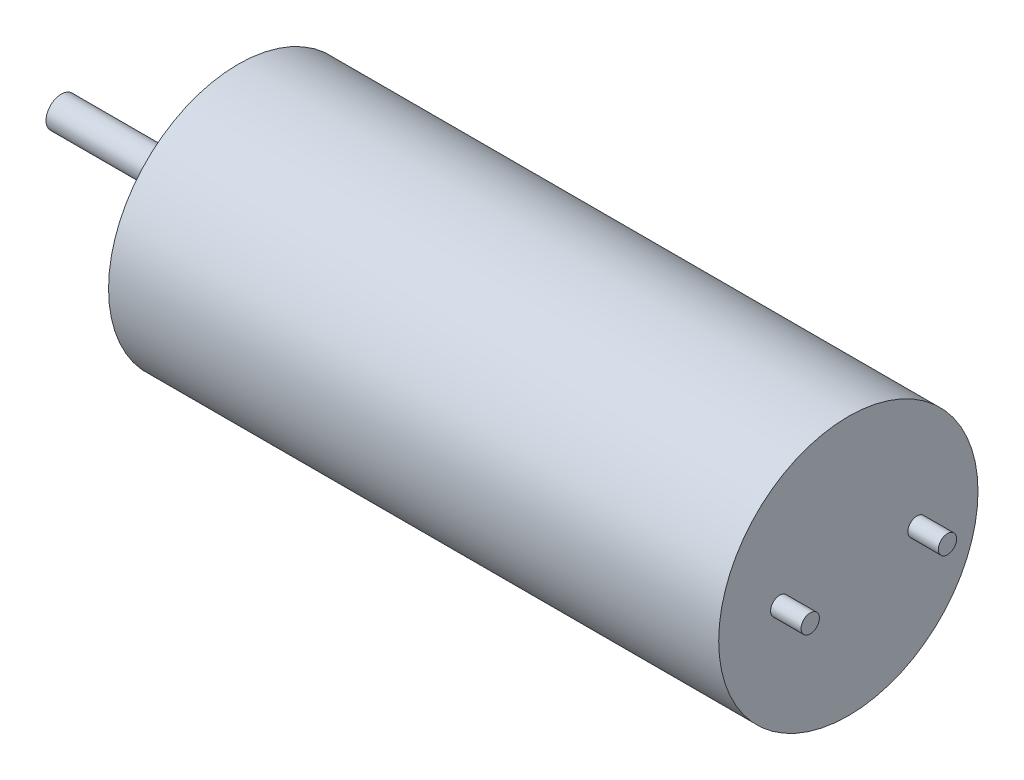
ISO-10303-21;
HEADER;
FILE_DESCRIPTION(('STEP AP214'),'2;1');
FILE_NAME('part.step','',(''),(''),'','','');
FILE_SCHEMA(('AUTOMOTIVE_DESIGN { 1 0 10303 214 1 1 1 1 }'));
ENDSEC;
DATA;
#1=APPLICATION_CONTEXT('core data for automotive mechanical design processes');
#2=APPLICATION_PROTOCOL_DEFINITION('international standard','automotive_design',2000,#1);
#3=PRODUCT_CONTEXT('',#1,'mechanical');
#4=PRODUCT('Part','Part','',(#3));
#5=PRODUCT_RELATED_PRODUCT_CATEGORY('part','',(#4));
#6=PRODUCT_DEFINITION_FORMATION('','',#4);
#7=PRODUCT_DEFINITION_CONTEXT('part definition',#1,'design');
#8=PRODUCT_DEFINITION('design','',#6,#7);
#9=PRODUCT_DEFINITION_SHAPE('','',#8);
#10=(LENGTH_UNIT() NAMED_UNIT(*) SI_UNIT(.MILLI.,.METRE.));
#11=(NAMED_UNIT(*) PLANE_ANGLE_UNIT() SI_UNIT($,.RADIAN.));
#12=(NAMED_UNIT(*) SI_UNIT($,.STERADIAN.) SOLID_ANGLE_UNIT());
#13=UNCERTAINTY_MEASURE_WITH_UNIT(LENGTH_MEASURE(1.E-05),#10,'distance_accuracy_value','');
#14=(GEOMETRIC_REPRESENTATION_CONTEXT(3) GLOBAL_UNCERTAINTY_ASSIGNED_CONTEXT((#13)) GLOBAL_UNIT_ASSIGNED_CONTEXT((#10,
#11,#12)) REPRESENTATION_CONTEXT('',''));
#15=CARTESIAN_POINT('',(0.,0.,0.));
#16=DIRECTION('',(0.,0.,1.));
#17=DIRECTION('',(1.,0.,0.));
#18=AXIS2_PLACEMENT_3D('',#15,#16,#17);
#19=CARTESIAN_POINT('',(20.,0.,0.));
#20=DIRECTION('',(-1.,0.,0.));
#21=DIRECTION('',(0.,0.,1.));
#22=AXIS2_PLACEMENT_3D('',#19,#20,#21);
#23=CYLINDRICAL_SURFACE('',#22,4.25);
#24=CARTESIAN_POINT('',(20.,0.,0.));
#25=DIRECTION('',(1.,0.,0.));
#26=DIRECTION('',(0.,0.,-1.));
#27=AXIS2_PLACEMENT_3D('',#24,#25,#26);
#28=CIRCLE('',#27,4.25);
#29=CARTESIAN_POINT('',(20.,0.,-4.25));
#30=VERTEX_POINT('',#29);
#31=EDGE_CURVE('E51',#30,#30,#28,.T.);
#32=ORIENTED_EDGE('',*,*,#31,.F.);
#33=EDGE_LOOP('',(#32));
#34=FACE_BOUND('',#33,.T.);
#35=CARTESIAN_POINT('',(0.,0.,0.));
#36=DIRECTION('',(1.,0.,0.));
#37=DIRECTION('',(0.,0.,-1.));
#38=AXIS2_PLACEMENT_3D('',#35,#36,#37);
#39=CIRCLE('',#38,4.25);
#40=CARTESIAN_POINT('',(0.,0.,-4.25));
#41=VERTEX_POINT('',#40);
#42=EDGE_CURVE('E40',#41,#41,#39,.T.);
#43=ORIENTED_EDGE('',*,*,#42,.T.);
#44=EDGE_LOOP('',(#43));
#45=FACE_BOUND('',#44,.T.);
#46=ADVANCED_FACE('F37',(#34,#45),#23,.T.);
#47=CARTESIAN_POINT('',(20.,0.,0.));
#48=DIRECTION('',(1.,0.,0.));
#49=DIRECTION('',(0.,0.,-1.));
#50=AXIS2_PLACEMENT_3D('',#47,#48,#49);
#51=PLANE('',#50);
#52=CARTESIAN_POINT('',(20.,0.,-2.25));
#53=DIRECTION('',(1.,0.,0.));
#54=DIRECTION('',(0.,0.,-1.));
#55=AXIS2_PLACEMENT_3D('',#52,#53,#54);
#56=CIRCLE('',#55,0.3);
#57=CARTESIAN_POINT('',(20.,0.,-2.55));
#58=VERTEX_POINT('',#57);
#59=EDGE_CURVE('E192',#58,#58,#56,.T.);
#60=ORIENTED_EDGE('',*,*,#59,.F.);
#61=EDGE_LOOP('',(#60));
#62=FACE_BOUND('',#61,.T.);
#63=CARTESIAN_POINT('',(20.,0.,2.25));
#64=DIRECTION('',(1.,0.,0.));
#65=DIRECTION('',(0.,0.,-1.));
#66=AXIS2_PLACEMENT_3D('',#63,#64,#65);
#67=CIRCLE('',#66,0.3);
#68=CARTESIAN_POINT('',(20.,0.,1.95));
#69=VERTEX_POINT('',#68);
#70=EDGE_CURVE('E185',#69,#69,#67,.T.);
#71=ORIENTED_EDGE('',*,*,#70,.F.);
#72=EDGE_LOOP('',(#71));
#73=FACE_BOUND('',#72,.T.);
#74=ORIENTED_EDGE('',*,*,#31,.T.);
#75=EDGE_LOOP('',(#74));
#76=FACE_BOUND('',#75,.T.);
#77=ADVANCED_FACE('F72',(#62,#73,#76),#51,.T.);
#78=CARTESIAN_POINT('',(0.,0.,0.));
#79=DIRECTION('',(1.,0.,0.));
#80=DIRECTION('',(0.,0.,-1.));
#81=AXIS2_PLACEMENT_3D('',#78,#79,#80);
#82=PLANE('',#81);
#83=CARTESIAN_POINT('',(0.,0.,0.));
#84=DIRECTION('',(-1.,0.,0.));
#85=DIRECTION('',(0.,0.,1.));
#86=AXIS2_PLACEMENT_3D('',#83,#84,#85);
#87=CIRCLE('',#86,1.2);
#88=CARTESIAN_POINT('',(0.,0.,1.2));
#89=VERTEX_POINT('',#88);
#90=EDGE_CURVE('E45',#89,#89,#87,.T.);
#91=ORIENTED_EDGE('',*,*,#90,.F.);
#92=EDGE_LOOP('',(#91));
#93=FACE_BOUND('',#92,.T.);
#94=ORIENTED_EDGE('',*,*,#42,.F.);
#95=EDGE_LOOP('',(#94));
#96=FACE_BOUND('',#95,.T.);
#97=ADVANCED_FACE('F69',(#93,#96),#82,.F.);
#98=CARTESIAN_POINT('',(-0.8,0.,0.));
#99=DIRECTION('',(1.,0.,0.));
#100=DIRECTION('',(0.,0.,-1.));
#101=AXIS2_PLACEMENT_3D('',#98,#99,#100);
#102=CYLINDRICAL_SURFACE('',#101,1.2);
#103=CARTESIAN_POINT('',(-0.8,0.,0.));
#104=DIRECTION('',(-1.,0.,0.));
#105=DIRECTION('',(0.,0.,1.));
#106=AXIS2_PLACEMENT_3D('',#103,#104,#105);
#107=CIRCLE('',#106,1.2);
#108=CARTESIAN_POINT('',(-0.8,0.,1.2));
#109=VERTEX_POINT('',#108);
#110=EDGE_CURVE('E57',#109,#109,#107,.T.);
#111=ORIENTED_EDGE('',*,*,#110,.F.);
#112=EDGE_LOOP('',(#111));
#113=FACE_BOUND('',#112,.T.);
#114=ORIENTED_EDGE('',*,*,#90,.T.);
#115=EDGE_LOOP('',(#114));
#116=FACE_BOUND('',#115,.T.);
#117=ADVANCED_FACE('F71',(#113,#116),#102,.T.);
#118=CARTESIAN_POINT('',(-0.8,0.,0.));
#119=DIRECTION('',(-1.,0.,0.));
#120=DIRECTION('',(0.,0.,1.));
#121=AXIS2_PLACEMENT_3D('',#118,#119,#120);
#122=PLANE('',#121);
#123=CARTESIAN_POINT('',(-0.8,0.,0.));
#124=DIRECTION('',(-1.,0.,0.));
#125=DIRECTION('',(0.,0.,1.));
#126=AXIS2_PLACEMENT_3D('',#123,#124,#125);
#127=CIRCLE('',#126,0.5);
#128=CARTESIAN_POINT('',(-0.8,0.,0.5));
#129=VERTEX_POINT('',#128);
#130=EDGE_CURVE('E10',#129,#129,#127,.T.);
#131=ORIENTED_EDGE('',*,*,#130,.F.);
#132=EDGE_LOOP('',(#131));
#133=FACE_BOUND('',#132,.T.);
#134=ORIENTED_EDGE('',*,*,#110,.T.);
#135=EDGE_LOOP('',(#134));
#136=FACE_BOUND('',#135,.T.);
#137=ADVANCED_FACE('F78',(#133,#136),#122,.T.);
#138=CARTESIAN_POINT('',(-5.8,0.,0.));
#139=DIRECTION('',(1.,0.,0.));
#140=DIRECTION('',(0.,0.,-1.));
#141=AXIS2_PLACEMENT_3D('',#138,#139,#140);
#142=CYLINDRICAL_SURFACE('',#141,0.5);
#143=CARTESIAN_POINT('',(-5.8,0.,0.));
#144=DIRECTION('',(-1.,0.,0.));
#145=DIRECTION('',(0.,0.,1.));
#146=AXIS2_PLACEMENT_3D('',#143,#144,#145);
#147=CIRCLE('',#146,0.5);
#148=CARTESIAN_POINT('',(-5.8,0.,0.5));
#149=VERTEX_POINT('',#148);
#150=EDGE_CURVE('E55',#149,#149,#147,.T.);
#151=ORIENTED_EDGE('',*,*,#150,.F.);
#152=EDGE_LOOP('',(#151));
#153=FACE_BOUND('',#152,.T.);
#154=ORIENTED_EDGE('',*,*,#130,.T.);
#155=EDGE_LOOP('',(#154));
#156=FACE_BOUND('',#155,.T.);
#157=ADVANCED_FACE('F146',(#153,#156),#142,.T.);
#158=CARTESIAN_POINT('',(-5.8,0.,0.));
#159=DIRECTION('',(-1.,0.,0.));
#160=DIRECTION('',(0.,0.,1.));
#161=AXIS2_PLACEMENT_3D('',#158,#159,#160);
#162=PLANE('',#161);
#163=ORIENTED_EDGE('',*,*,#150,.T.);
#164=EDGE_LOOP('',(#163));
#165=FACE_BOUND('',#164,.T.);
#166=ADVANCED_FACE('F99',(#165),#162,.T.);
#167=CARTESIAN_POINT('',(21.,0.,2.25));
#168=DIRECTION('',(-1.,0.,0.));
#169=DIRECTION('',(0.,0.,1.));
#170=AXIS2_PLACEMENT_3D('',#167,#168,#169);
#171=CYLINDRICAL_SURFACE('',#170,0.3);
#172=CARTESIAN_POINT('',(21.,0.,2.25));
#173=DIRECTION('',(1.,0.,0.));
#174=DIRECTION('',(0.,0.,-1.));
#175=AXIS2_PLACEMENT_3D('',#172,#173,#174);
#176=CIRCLE('',#175,0.3);
#177=CARTESIAN_POINT('',(21.,0.,1.95));
#178=VERTEX_POINT('',#177);
#179=EDGE_CURVE('E182',#178,#178,#176,.T.);
#180=ORIENTED_EDGE('',*,*,#179,.F.);
#181=EDGE_LOOP('',(#180));
#182=FACE_BOUND('',#181,.T.);
#183=ORIENTED_EDGE('',*,*,#70,.T.);
#184=EDGE_LOOP('',(#183));
#185=FACE_BOUND('',#184,.T.);
#186=ADVANCED_FACE('F104',(#182,#185),#171,.T.);
#187=CARTESIAN_POINT('',(21.,0.,2.25));
#188=DIRECTION('',(1.,0.,0.));
#189=DIRECTION('',(0.,0.,-1.));
#190=AXIS2_PLACEMENT_3D('',#187,#188,#189);
#191=PLANE('',#190);
#192=ORIENTED_EDGE('',*,*,#179,.T.);
#193=EDGE_LOOP('',(#192));
#194=FACE_BOUND('',#193,.T.);
#195=ADVANCED_FACE('F109',(#194),#191,.T.);
#196=CARTESIAN_POINT('',(21.,0.,-2.25));
#197=DIRECTION('',(-1.,0.,0.));
#198=DIRECTION('',(0.,0.,1.));
#199=AXIS2_PLACEMENT_3D('',#196,#197,#198);
#200=CYLINDRICAL_SURFACE('',#199,0.3);
#201=CARTESIAN_POINT('',(21.,0.,-2.25));
#202=DIRECTION('',(1.,0.,0.));
#203=DIRECTION('',(0.,0.,-1.));
#204=AXIS2_PLACEMENT_3D('',#201,#202,#203);
#205=CIRCLE('',#204,0.3);
#206=CARTESIAN_POINT('',(21.,0.,-2.55));
#207=VERTEX_POINT('',#206);
#208=EDGE_CURVE('E190',#207,#207,#205,.T.);
#209=ORIENTED_EDGE('',*,*,#208,.F.);
#210=EDGE_LOOP('',(#209));
#211=FACE_BOUND('',#210,.T.);
#212=ORIENTED_EDGE('',*,*,#59,.T.);
#213=EDGE_LOOP('',(#212));
#214=FACE_BOUND('',#213,.T.);
#215=ADVANCED_FACE('F119',(#211,#214),#200,.T.);
#216=CARTESIAN_POINT('',(21.,0.,-2.25));
#217=DIRECTION('',(1.,0.,0.));
#218=DIRECTION('',(0.,0.,-1.));
#219=AXIS2_PLACEMENT_3D('',#216,#217,#218);
#220=PLANE('',#219);
#221=ORIENTED_EDGE('',*,*,#208,.T.);
#222=EDGE_LOOP('',(#221));
#223=FACE_BOUND('',#222,.T.);
#224=ADVANCED_FACE('F129',(#223),#220,.T.);
#225=CLOSED_SHELL('',(#46,#77,#97,#117,#137,#157,#166,#186,#195,#215,#224));
#226=MANIFOLD_SOLID_BREP('B2',#225);
#227=ADVANCED_BREP_SHAPE_REPRESENTATION('',(#18,#226),#14);
#228=SHAPE_DEFINITION_REPRESENTATION(#9,#227);
ENDSEC;
END-ISO-10303-21;
